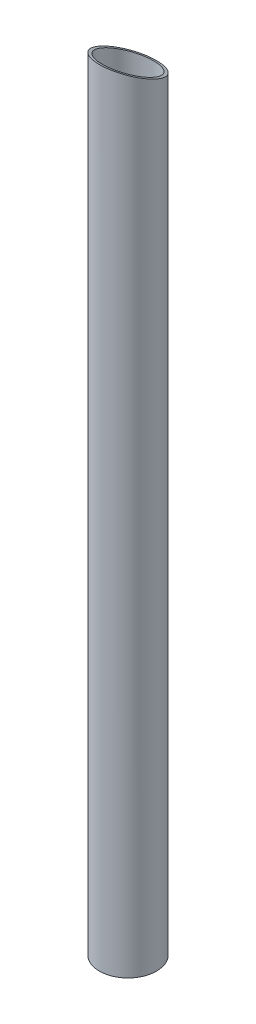
ISO-10303-21;
HEADER;
FILE_DESCRIPTION(('STEP AP214'),'2;1');
FILE_NAME('part.step','',(''),(''),'','','');
FILE_SCHEMA(('AUTOMOTIVE_DESIGN { 1 0 10303 214 1 1 1 1 }'));
ENDSEC;
DATA;
#1=APPLICATION_CONTEXT('core data for automotive mechanical design processes');
#2=APPLICATION_PROTOCOL_DEFINITION('international standard','automotive_design',2000,#1);
#3=PRODUCT_CONTEXT('',#1,'mechanical');
#4=PRODUCT('Part','Part','',(#3));
#5=PRODUCT_RELATED_PRODUCT_CATEGORY('part','',(#4));
#6=PRODUCT_DEFINITION_FORMATION('','',#4);
#7=PRODUCT_DEFINITION_CONTEXT('part definition',#1,'design');
#8=PRODUCT_DEFINITION('design','',#6,#7);
#9=PRODUCT_DEFINITION_SHAPE('','',#8);
#10=(LENGTH_UNIT() NAMED_UNIT(*) SI_UNIT(.MILLI.,.METRE.));
#11=(NAMED_UNIT(*) PLANE_ANGLE_UNIT() SI_UNIT($,.RADIAN.));
#12=(NAMED_UNIT(*) SI_UNIT($,.STERADIAN.) SOLID_ANGLE_UNIT());
#13=UNCERTAINTY_MEASURE_WITH_UNIT(LENGTH_MEASURE(1.E-05),#10,'distance_accuracy_value','');
#14=(GEOMETRIC_REPRESENTATION_CONTEXT(3) GLOBAL_UNCERTAINTY_ASSIGNED_CONTEXT((#13)) GLOBAL_UNIT_ASSIGNED_CONTEXT((#10,
#11,#12)) REPRESENTATION_CONTEXT('',''));
#15=CARTESIAN_POINT('',(0.,0.,0.));
#16=DIRECTION('',(0.,0.,1.));
#17=DIRECTION('',(1.,0.,0.));
#18=AXIS2_PLACEMENT_3D('',#15,#16,#17);
#19=CARTESIAN_POINT('',(703.,60.3,192.458827838499));
#20=DIRECTION('',(0.,1.,0.));
#21=DIRECTION('',(0.,0.,1.));
#22=AXIS2_PLACEMENT_3D('',#19,#20,#21);
#23=CYLINDRICAL_SURFACE('',#22,17.2);
#24=CARTESIAN_POINT('',(703.,61.9,192.458827838499));
#25=DIRECTION('',(0.,-1.,0.));
#26=DIRECTION('',(0.,0.,-1.));
#27=AXIS2_PLACEMENT_3D('',#24,#25,#26);
#28=CIRCLE('',#27,17.2);
#29=CARTESIAN_POINT('',(703.,61.9,175.258827838499));
#30=VERTEX_POINT('',#29);
#31=EDGE_CURVE('E93',#30,#30,#28,.T.);
#32=ORIENTED_EDGE('',*,*,#31,.T.);
#33=EDGE_LOOP('',(#32));
#34=FACE_BOUND('',#33,.T.);
#35=CARTESIAN_POINT('',(703.,583.,192.458827838499));
#36=DIRECTION('',(0.,0.915958558610701,-0.401272873376469));
#37=DIRECTION('',(0.,0.401272873376469,0.915958558610701));
#38=AXIS2_PLACEMENT_3D('',#35,#36,#37);
#39=ELLIPSE('',#38,18.7781421313301,17.2);
#40=CARTESIAN_POINT('',(703.,590.53515904971,209.658827838499));
#41=VERTEX_POINT('',#40);
#42=EDGE_CURVE('E88',#41,#41,#39,.T.);
#43=ORIENTED_EDGE('',*,*,#42,.T.);
#44=EDGE_LOOP('',(#43));
#45=FACE_BOUND('',#44,.T.);
#46=ADVANCED_FACE('F35',(#34,#45),#23,.F.);
#47=CARTESIAN_POINT('',(703.,60.3,192.458827838499));
#48=DIRECTION('',(0.,1.,0.));
#49=DIRECTION('',(0.,0.,1.));
#50=AXIS2_PLACEMENT_3D('',#47,#48,#49);
#51=CYLINDRICAL_SURFACE('',#50,19.2);
#52=DIRECTION('',(0.,1.,0.));
#53=VECTOR('',#52,1.);
#54=CARTESIAN_POINT('',(702.89947643979,60.2999999999998,173.259090990984));
#55=LINE('',#54,#53);
#56=CARTESIAN_POINT('',(702.89947643979,509.3,173.259090990979));
#57=VERTEX_POINT('',#56);
#58=CARTESIAN_POINT('',(702.89947643979,510.3,173.259090990979));
#59=VERTEX_POINT('',#58);
#60=EDGE_CURVE('E43',#57,#59,#55,.T.);
#61=ORIENTED_EDGE('',*,*,#60,.T.);
#62=CARTESIAN_POINT('',(703.,510.3,192.458827838494));
#63=DIRECTION('',(0.,1.,0.));
#64=DIRECTION('',(0.,0.,1.));
#65=AXIS2_PLACEMENT_3D('',#62,#63,#64);
#66=CIRCLE('',#65,19.2);
#67=CARTESIAN_POINT('',(700.942988243817,510.3,173.369335895681));
#68=VERTEX_POINT('',#67);
#69=EDGE_CURVE('E11',#59,#68,#66,.T.);
#70=ORIENTED_EDGE('',*,*,#69,.T.);
#71=DIRECTION('',(0.,1.,0.));
#72=VECTOR('',#71,1.);
#73=CARTESIAN_POINT('',(700.942988243817,60.3,173.369335895681));
#74=LINE('',#73,#72);
#75=CARTESIAN_POINT('',(700.942988243817,509.3,173.369335895676));
#76=VERTEX_POINT('',#75);
#77=EDGE_CURVE('E101',#68,#76,#74,.F.);
#78=ORIENTED_EDGE('',*,*,#77,.T.);
#79=CARTESIAN_POINT('',(703.,509.3,192.458827838494));
#80=DIRECTION('',(0.,-1.,0.));
#81=DIRECTION('',(0.,0.,-1.));
#82=AXIS2_PLACEMENT_3D('',#79,#80,#81);
#83=CIRCLE('',#82,19.2);
#84=EDGE_CURVE('E81',#76,#57,#83,.T.);
#85=ORIENTED_EDGE('',*,*,#84,.T.);
#86=EDGE_LOOP('',(#61,#70,#78,#85));
#87=FACE_BOUND('',#86,.T.);
#88=CARTESIAN_POINT('',(703.,61.9,192.458827838499));
#89=DIRECTION('',(0.,-1.,0.));
#90=DIRECTION('',(0.,0.,-1.));
#91=AXIS2_PLACEMENT_3D('',#88,#89,#90);
#92=CIRCLE('',#91,19.2);
#93=CARTESIAN_POINT('',(703.,61.9,173.258827838499));
#94=VERTEX_POINT('',#93);
#95=EDGE_CURVE('E98',#94,#94,#92,.T.);
#96=ORIENTED_EDGE('',*,*,#95,.F.);
#97=EDGE_LOOP('',(#96));
#98=FACE_BOUND('',#97,.T.);
#99=CARTESIAN_POINT('',(703.,583.,192.458827838499));
#100=DIRECTION('',(0.,0.915958558610701,-0.401272873376469));
#101=DIRECTION('',(0.,0.401272873376469,0.915958558610701));
#102=AXIS2_PLACEMENT_3D('',#99,#100,#101);
#103=ELLIPSE('',#102,20.961647030322,19.2);
#104=CARTESIAN_POINT('',(703.,591.41134033456,211.658827838499));
#105=VERTEX_POINT('',#104);
#106=EDGE_CURVE('E90',#105,#105,#103,.T.);
#107=ORIENTED_EDGE('',*,*,#106,.F.);
#108=EDGE_LOOP('',(#107));
#109=FACE_BOUND('',#108,.T.);
#110=ADVANCED_FACE('F104',(#87,#98,#109),#51,.T.);
#111=CARTESIAN_POINT('',(703.,61.9,192.458827838499));
#112=DIRECTION('',(0.,-1.,0.));
#113=DIRECTION('',(0.,0.,-1.));
#114=AXIS2_PLACEMENT_3D('',#111,#112,#113);
#115=PLANE('',#114);
#116=ORIENTED_EDGE('',*,*,#31,.F.);
#117=EDGE_LOOP('',(#116));
#118=FACE_BOUND('',#117,.T.);
#119=ORIENTED_EDGE('',*,*,#95,.T.);
#120=EDGE_LOOP('',(#119));
#121=FACE_BOUND('',#120,.T.);
#122=ADVANCED_FACE('F37',(#118,#121),#115,.T.);
#123=CARTESIAN_POINT('',(703.,583.,192.458827838499));
#124=DIRECTION('',(0.,0.915958558610701,-0.401272873376469));
#125=DIRECTION('',(0.,0.401272873376469,0.915958558610701));
#126=AXIS2_PLACEMENT_3D('',#123,#124,#125);
#127=PLANE('',#126);
#128=ORIENTED_EDGE('',*,*,#42,.F.);
#129=EDGE_LOOP('',(#128));
#130=FACE_BOUND('',#129,.T.);
#131=ORIENTED_EDGE('',*,*,#106,.T.);
#132=EDGE_LOOP('',(#131));
#133=FACE_BOUND('',#132,.T.);
#134=ADVANCED_FACE('F108',(#130,#133),#127,.T.);
#135=CARTESIAN_POINT('',(582.72681620454,510.3,163.988140156241));
#136=DIRECTION('',(0.,1.,0.));
#137=DIRECTION('',(0.,0.,1.));
#138=AXIS2_PLACEMENT_3D('',#135,#136,#137);
#139=PLANE('',#138);
#140=DIRECTION('',(0.00523560209424027,0.,0.99998629414143));
#141=VECTOR('',#140,1.);
#142=CARTESIAN_POINT('',(702.847643979057,510.3,163.359226678983));
#143=LINE('',#142,#141);
#144=CARTESIAN_POINT('',(702.9,510.3,173.359089620398));
#145=VERTEX_POINT('',#144);
#146=EDGE_CURVE('E77',#59,#145,#143,.T.);
#147=ORIENTED_EDGE('',*,*,#146,.T.);
#148=DIRECTION('',(-0.99998629414143,0.,0.00523560209424018));
#149=VECTOR('',#148,1.);
#150=CARTESIAN_POINT('',(582.779172225483,510.3,173.988003097655));
#151=LINE('',#150,#149);
#152=EDGE_CURVE('E78',#145,#68,#151,.T.);
#153=ORIENTED_EDGE('',*,*,#152,.T.);
#154=ORIENTED_EDGE('',*,*,#69,.F.);
#155=EDGE_LOOP('',(#147,#153,#154));
#156=FACE_BOUND('',#155,.T.);
#157=ADVANCED_FACE('F106',(#156),#139,.F.);
#158=CARTESIAN_POINT('',(702.847643979057,510.3,163.359226678983));
#159=DIRECTION('',(0.99998629414143,0.,-0.00523560209424027));
#160=DIRECTION('',(-0.00523560209424027,0.,-0.99998629414143));
#161=AXIS2_PLACEMENT_3D('',#158,#159,#160);
#162=PLANE('',#161);
#163=DIRECTION('',(0.00523560209424027,0.,0.99998629414143));
#164=VECTOR('',#163,1.);
#165=CARTESIAN_POINT('',(702.847643979057,509.3,163.359226678983));
#166=LINE('',#165,#164);
#167=CARTESIAN_POINT('',(702.9,509.3,173.359089620398));
#168=VERTEX_POINT('',#167);
#169=EDGE_CURVE('E70',#57,#168,#166,.T.);
#170=ORIENTED_EDGE('',*,*,#169,.T.);
#171=DIRECTION('',(0.,1.,0.));
#172=VECTOR('',#171,1.);
#173=CARTESIAN_POINT('',(702.9,510.3,173.359089620398));
#174=LINE('',#173,#172);
#175=EDGE_CURVE('E72',#168,#145,#174,.T.);
#176=ORIENTED_EDGE('',*,*,#175,.T.);
#177=ORIENTED_EDGE('',*,*,#146,.F.);
#178=ORIENTED_EDGE('',*,*,#60,.F.);
#179=EDGE_LOOP('',(#170,#176,#177,#178));
#180=FACE_BOUND('',#179,.T.);
#181=ADVANCED_FACE('F71',(#180),#162,.F.);
#182=CARTESIAN_POINT('',(582.72681620454,509.3,163.988140156241));
#183=DIRECTION('',(0.,-1.,0.));
#184=DIRECTION('',(0.,0.,-1.));
#185=AXIS2_PLACEMENT_3D('',#182,#183,#184);
#186=PLANE('',#185);
#187=DIRECTION('',(0.99998629414143,0.,-0.00523560209424018));
#188=VECTOR('',#187,1.);
#189=CARTESIAN_POINT('',(582.779172225483,509.3,173.988003097655));
#190=LINE('',#189,#188);
#191=EDGE_CURVE('E50',#76,#168,#190,.T.);
#192=ORIENTED_EDGE('',*,*,#191,.T.);
#193=ORIENTED_EDGE('',*,*,#169,.F.);
#194=ORIENTED_EDGE('',*,*,#84,.F.);
#195=EDGE_LOOP('',(#192,#193,#194));
#196=FACE_BOUND('',#195,.T.);
#197=ADVANCED_FACE('F80',(#196),#186,.F.);
#198=CARTESIAN_POINT('',(582.779172225483,509.3,173.988003097655));
#199=DIRECTION('',(0.00523560209424018,0.,0.99998629414143));
#200=DIRECTION('',(0.99998629414143,0.,-0.00523560209424018));
#201=AXIS2_PLACEMENT_3D('',#198,#199,#200);
#202=PLANE('',#201);
#203=ORIENTED_EDGE('',*,*,#152,.F.);
#204=ORIENTED_EDGE('',*,*,#175,.F.);
#205=ORIENTED_EDGE('',*,*,#191,.F.);
#206=ORIENTED_EDGE('',*,*,#77,.F.);
#207=EDGE_LOOP('',(#203,#204,#205,#206));
#208=FACE_BOUND('',#207,.T.);
#209=ADVANCED_FACE('F84',(#208),#202,.F.);
#210=CLOSED_SHELL('',(#46,#110,#122,#134,#157,#181,#197,#209));
#211=MANIFOLD_SOLID_BREP('B2',#210);
#212=ADVANCED_BREP_SHAPE_REPRESENTATION('',(#18,#211),#14);
#213=SHAPE_DEFINITION_REPRESENTATION(#9,#212);
ENDSEC;
END-ISO-10303-21;
